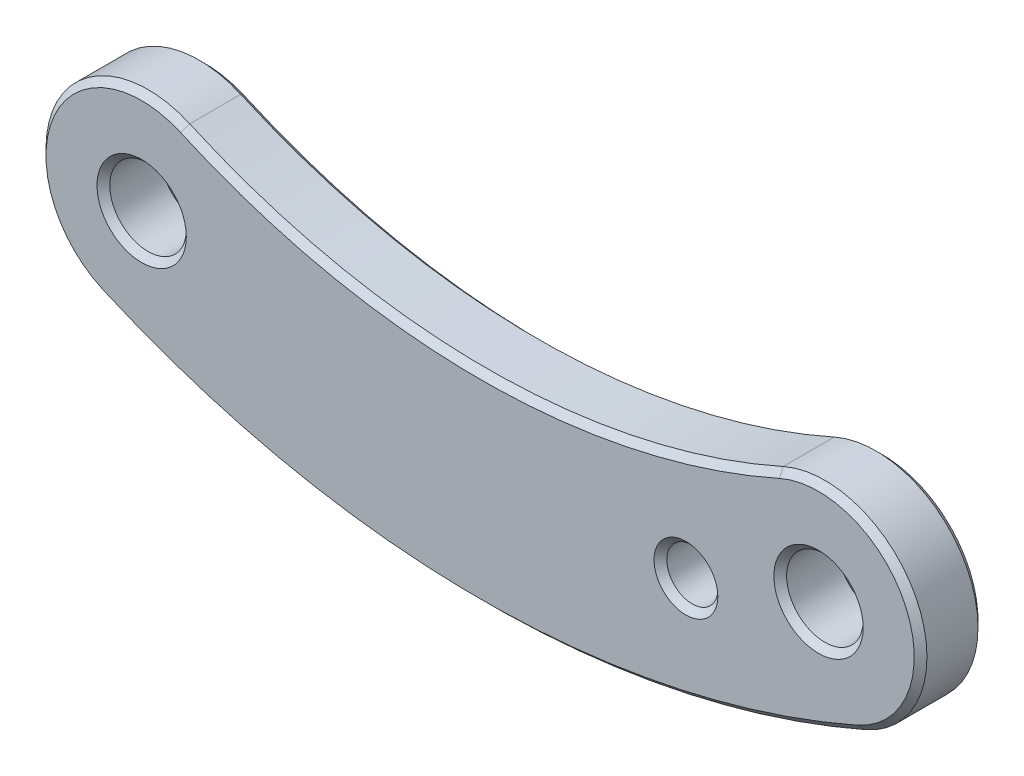
ISO-10303-21;
HEADER;
FILE_DESCRIPTION(('STEP AP214'),'2;1');
FILE_NAME('part.step','',(''),(''),'','','');
FILE_SCHEMA(('AUTOMOTIVE_DESIGN { 1 0 10303 214 1 1 1 1 }'));
ENDSEC;
DATA;
#1=APPLICATION_CONTEXT('core data for automotive mechanical design processes');
#2=APPLICATION_PROTOCOL_DEFINITION('international standard','automotive_design',2000,#1);
#3=PRODUCT_CONTEXT('',#1,'mechanical');
#4=PRODUCT('Part','Part','',(#3));
#5=PRODUCT_RELATED_PRODUCT_CATEGORY('part','',(#4));
#6=PRODUCT_DEFINITION_FORMATION('','',#4);
#7=PRODUCT_DEFINITION_CONTEXT('part definition',#1,'design');
#8=PRODUCT_DEFINITION('design','',#6,#7);
#9=PRODUCT_DEFINITION_SHAPE('','',#8);
#10=(LENGTH_UNIT() NAMED_UNIT(*) SI_UNIT(.MILLI.,.METRE.));
#11=(NAMED_UNIT(*) PLANE_ANGLE_UNIT() SI_UNIT($,.RADIAN.));
#12=(NAMED_UNIT(*) SI_UNIT($,.STERADIAN.) SOLID_ANGLE_UNIT());
#13=UNCERTAINTY_MEASURE_WITH_UNIT(LENGTH_MEASURE(1.E-05),#10,'distance_accuracy_value','');
#14=(GEOMETRIC_REPRESENTATION_CONTEXT(3) GLOBAL_UNCERTAINTY_ASSIGNED_CONTEXT((#13)) GLOBAL_UNIT_ASSIGNED_CONTEXT((#10,
#11,#12)) REPRESENTATION_CONTEXT('',''));
#15=CARTESIAN_POINT('',(0.,0.,0.));
#16=DIRECTION('',(0.,0.,1.));
#17=DIRECTION('',(1.,0.,0.));
#18=AXIS2_PLACEMENT_3D('',#15,#16,#17);
#19=CARTESIAN_POINT('',(-13.265,30.2165480324937,5.));
#20=DIRECTION('',(0.,0.,1.));
#21=DIRECTION('',(1.,0.,0.));
#22=AXIS2_PLACEMENT_3D('',#19,#20,#21);
#23=PLANE('',#22);
#24=CARTESIAN_POINT('',(-10.3960099464018,-3.59485426607447,5.));
#25=DIRECTION('',(0.,0.,1.));
#26=DIRECTION('',(1.,0.,0.));
#27=AXIS2_PLACEMENT_3D('',#24,#25,#26);
#28=CIRCLE('',#27,2.49999999999999);
#29=CARTESIAN_POINT('',(-7.89600994640185,-3.59485426607447,5.));
#30=VERTEX_POINT('',#29);
#31=EDGE_CURVE('E139',#30,#30,#28,.F.);
#32=ORIENTED_EDGE('',*,*,#31,.T.);
#33=EDGE_LOOP('',(#32));
#34=FACE_BOUND('',#33,.T.);
#35=CARTESIAN_POINT('',(0.,0.,5.));
#36=DIRECTION('',(0.,0.,1.));
#37=DIRECTION('',(1.,0.,0.));
#38=AXIS2_PLACEMENT_3D('',#35,#36,#37);
#39=CIRCLE('',#38,3.5);
#40=CARTESIAN_POINT('',(3.5,0.,5.));
#41=VERTEX_POINT('',#40);
#42=EDGE_CURVE('E162',#41,#41,#39,.F.);
#43=ORIENTED_EDGE('',*,*,#42,.T.);
#44=EDGE_LOOP('',(#43));
#45=FACE_BOUND('',#44,.T.);
#46=CARTESIAN_POINT('',(-53.06,0.,5.));
#47=DIRECTION('',(0.,0.,1.));
#48=DIRECTION('',(1.,0.,0.));
#49=AXIS2_PLACEMENT_3D('',#46,#47,#48);
#50=CIRCLE('',#49,3.49999999999998);
#51=CARTESIAN_POINT('',(-49.56,0.,5.));
#52=VERTEX_POINT('',#51);
#53=EDGE_CURVE('E165',#52,#52,#50,.F.);
#54=ORIENTED_EDGE('',*,*,#53,.T.);
#55=EDGE_LOOP('',(#54));
#56=FACE_BOUND('',#55,.T.);
#57=CARTESIAN_POINT('',(0.,0.,5.));
#58=DIRECTION('',(0.,0.,1.));
#59=DIRECTION('',(1.,0.,0.));
#60=AXIS2_PLACEMENT_3D('',#57,#58,#59);
#61=CIRCLE('',#60,7.5);
#62=CARTESIAN_POINT('',(3.01477272727272,-6.86739728011221,5.));
#63=VERTEX_POINT('',#62);
#64=CARTESIAN_POINT('',(-3.06115384615384,6.84684870069272,5.));
#65=VERTEX_POINT('',#64);
#66=EDGE_CURVE('E116',#63,#65,#61,.T.);
#67=ORIENTED_EDGE('',*,*,#66,.T.);
#68=CARTESIAN_POINT('',(-26.53,59.3393554060035,5.));
#69=DIRECTION('',(0.,0.,1.));
#70=DIRECTION('',(1.,0.,0.));
#71=AXIS2_PLACEMENT_3D('',#68,#69,#70);
#72=CIRCLE('',#71,57.5);
#73=CARTESIAN_POINT('',(-49.9988461538462,6.84684870069272,5.));
#74=VERTEX_POINT('',#73);
#75=EDGE_CURVE('E112',#65,#74,#72,.F.);
#76=ORIENTED_EDGE('',*,*,#75,.T.);
#77=CARTESIAN_POINT('',(-53.06,0.,5.));
#78=DIRECTION('',(0.,0.,1.));
#79=DIRECTION('',(1.,0.,0.));
#80=AXIS2_PLACEMENT_3D('',#77,#78,#79);
#81=CIRCLE('',#80,7.49999999999999);
#82=CARTESIAN_POINT('',(-56.0747727272727,-6.86739728011222,5.));
#83=VERTEX_POINT('',#82);
#84=EDGE_CURVE('E107',#74,#83,#81,.T.);
#85=ORIENTED_EDGE('',*,*,#84,.T.);
#86=CARTESIAN_POINT('',(-26.53,60.4330960649874,5.));
#87=DIRECTION('',(0.,0.,1.));
#88=DIRECTION('',(1.,0.,0.));
#89=AXIS2_PLACEMENT_3D('',#86,#87,#88);
#90=CIRCLE('',#89,73.5);
#91=EDGE_CURVE('E109',#83,#63,#90,.T.);
#92=ORIENTED_EDGE('',*,*,#91,.T.);
#93=EDGE_LOOP('',(#67,#76,#85,#92));
#94=FACE_BOUND('',#93,.T.);
#95=ADVANCED_FACE('F39',(#34,#45,#56,#94),#23,.T.);
#96=CARTESIAN_POINT('',(-13.265,30.2165480324937,0.));
#97=DIRECTION('',(0.,0.,1.));
#98=DIRECTION('',(1.,0.,0.));
#99=AXIS2_PLACEMENT_3D('',#96,#97,#98);
#100=PLANE('',#99);
#101=CARTESIAN_POINT('',(-10.3960099464018,-3.59485426607447,0.));
#102=DIRECTION('',(0.,0.,1.));
#103=DIRECTION('',(1.,0.,0.));
#104=AXIS2_PLACEMENT_3D('',#101,#102,#103);
#105=CIRCLE('',#104,2.49999999999999);
#106=CARTESIAN_POINT('',(-7.89600994640185,-3.59485426607447,0.));
#107=VERTEX_POINT('',#106);
#108=EDGE_CURVE('E11',#107,#107,#105,.T.);
#109=ORIENTED_EDGE('',*,*,#108,.T.);
#110=EDGE_LOOP('',(#109));
#111=FACE_BOUND('',#110,.T.);
#112=CARTESIAN_POINT('',(0.,0.,0.));
#113=DIRECTION('',(0.,0.,1.));
#114=DIRECTION('',(1.,0.,0.));
#115=AXIS2_PLACEMENT_3D('',#112,#113,#114);
#116=CIRCLE('',#115,3.49999999999999);
#117=CARTESIAN_POINT('',(3.49999999999999,0.,0.));
#118=VERTEX_POINT('',#117);
#119=EDGE_CURVE('E183',#118,#118,#116,.T.);
#120=ORIENTED_EDGE('',*,*,#119,.T.);
#121=EDGE_LOOP('',(#120));
#122=FACE_BOUND('',#121,.T.);
#123=CARTESIAN_POINT('',(-53.06,0.,0.));
#124=DIRECTION('',(0.,0.,1.));
#125=DIRECTION('',(1.,0.,0.));
#126=AXIS2_PLACEMENT_3D('',#123,#124,#125);
#127=CIRCLE('',#126,3.49999999999999);
#128=CARTESIAN_POINT('',(-49.56,0.,0.));
#129=VERTEX_POINT('',#128);
#130=EDGE_CURVE('E180',#129,#129,#127,.T.);
#131=ORIENTED_EDGE('',*,*,#130,.T.);
#132=EDGE_LOOP('',(#131));
#133=FACE_BOUND('',#132,.T.);
#134=CARTESIAN_POINT('',(-53.06,0.,0.));
#135=DIRECTION('',(0.,0.,1.));
#136=DIRECTION('',(1.,0.,0.));
#137=AXIS2_PLACEMENT_3D('',#134,#135,#136);
#138=CIRCLE('',#137,7.49999999999999);
#139=CARTESIAN_POINT('',(-56.0747727272727,-6.8673972801122,0.));
#140=VERTEX_POINT('',#139);
#141=CARTESIAN_POINT('',(-49.9988461538462,6.84684870069272,0.));
#142=VERTEX_POINT('',#141);
#143=EDGE_CURVE('E175',#140,#142,#138,.F.);
#144=ORIENTED_EDGE('',*,*,#143,.T.);
#145=CARTESIAN_POINT('',(-26.53,59.3393554060035,0.));
#146=DIRECTION('',(0.,0.,1.));
#147=DIRECTION('',(1.,0.,0.));
#148=AXIS2_PLACEMENT_3D('',#145,#146,#147);
#149=CIRCLE('',#148,57.5);
#150=CARTESIAN_POINT('',(-3.06115384615384,6.84684870069272,0.));
#151=VERTEX_POINT('',#150);
#152=EDGE_CURVE('E177',#142,#151,#149,.T.);
#153=ORIENTED_EDGE('',*,*,#152,.T.);
#154=CARTESIAN_POINT('',(0.,0.,0.));
#155=DIRECTION('',(0.,0.,1.));
#156=DIRECTION('',(1.,0.,0.));
#157=AXIS2_PLACEMENT_3D('',#154,#155,#156);
#158=CIRCLE('',#157,7.5);
#159=CARTESIAN_POINT('',(3.01477272727271,-6.86739728011219,0.));
#160=VERTEX_POINT('',#159);
#161=EDGE_CURVE('E173',#151,#160,#158,.F.);
#162=ORIENTED_EDGE('',*,*,#161,.T.);
#163=CARTESIAN_POINT('',(-26.53,60.4330960649874,0.));
#164=DIRECTION('',(0.,0.,1.));
#165=DIRECTION('',(1.,0.,0.));
#166=AXIS2_PLACEMENT_3D('',#163,#164,#165);
#167=CIRCLE('',#166,73.5);
#168=EDGE_CURVE('E168',#160,#140,#167,.F.);
#169=ORIENTED_EDGE('',*,*,#168,.T.);
#170=EDGE_LOOP('',(#144,#153,#162,#169));
#171=FACE_BOUND('',#170,.T.);
#172=ADVANCED_FACE('F157',(#111,#122,#133,#171),#100,.F.);
#173=CARTESIAN_POINT('',(-26.53,60.4330960649874,5.));
#174=DIRECTION('',(0.,0.,-1.));
#175=DIRECTION('',(-1.,0.,0.));
#176=AXIS2_PLACEMENT_3D('',#173,#174,#175);
#177=CYLINDRICAL_SURFACE('',#176,74.);
#178=DIRECTION('',(0.,0.,-1.));
#179=VECTOR('',#178,1.);
#180=CARTESIAN_POINT('',(-56.2757575757576,-7.32522376545301,5.));
#181=LINE('',#180,#179);
#182=CARTESIAN_POINT('',(-56.2757575757576,-7.32522376545301,4.50000000000001));
#183=VERTEX_POINT('',#182);
#184=CARTESIAN_POINT('',(-56.2757575757576,-7.32522376545301,0.5));
#185=VERTEX_POINT('',#184);
#186=EDGE_CURVE('E215',#183,#185,#181,.T.);
#187=ORIENTED_EDGE('',*,*,#186,.T.);
#188=CARTESIAN_POINT('',(-26.53,60.4330960649874,0.5));
#189=DIRECTION('',(0.,0.,1.));
#190=DIRECTION('',(1.,0.,0.));
#191=AXIS2_PLACEMENT_3D('',#188,#189,#190);
#192=CIRCLE('',#191,74.);
#193=CARTESIAN_POINT('',(3.21575757575757,-7.32522376545302,0.5));
#194=VERTEX_POINT('',#193);
#195=EDGE_CURVE('E55',#185,#194,#192,.T.);
#196=ORIENTED_EDGE('',*,*,#195,.T.);
#197=DIRECTION('',(0.,0.,-1.));
#198=VECTOR('',#197,1.);
#199=CARTESIAN_POINT('',(3.21575757575757,-7.32522376545302,5.));
#200=LINE('',#199,#198);
#201=CARTESIAN_POINT('',(3.21575757575757,-7.32522376545302,4.50000000000001));
#202=VERTEX_POINT('',#201);
#203=EDGE_CURVE('E230',#202,#194,#200,.T.);
#204=ORIENTED_EDGE('',*,*,#203,.F.);
#205=CARTESIAN_POINT('',(-26.53,60.4330960649874,4.50000000000001));
#206=DIRECTION('',(0.,0.,1.));
#207=DIRECTION('',(1.,0.,0.));
#208=AXIS2_PLACEMENT_3D('',#205,#206,#207);
#209=CIRCLE('',#208,74.);
#210=EDGE_CURVE('E204',#202,#183,#209,.F.);
#211=ORIENTED_EDGE('',*,*,#210,.T.);
#212=EDGE_LOOP('',(#187,#196,#204,#211));
#213=FACE_BOUND('',#212,.T.);
#214=ADVANCED_FACE('F327',(#213),#177,.T.);
#215=CARTESIAN_POINT('',(0.,0.,5.));
#216=DIRECTION('',(0.,0.,-1.));
#217=DIRECTION('',(-1.,0.,0.));
#218=AXIS2_PLACEMENT_3D('',#215,#216,#217);
#219=CYLINDRICAL_SURFACE('',#218,8.);
#220=ORIENTED_EDGE('',*,*,#203,.T.);
#221=CARTESIAN_POINT('',(0.,0.,0.5));
#222=DIRECTION('',(0.,0.,1.));
#223=DIRECTION('',(1.,0.,0.));
#224=AXIS2_PLACEMENT_3D('',#221,#222,#223);
#225=CIRCLE('',#224,8.);
#226=CARTESIAN_POINT('',(-3.26523076923076,7.30330528073889,0.5));
#227=VERTEX_POINT('',#226);
#228=EDGE_CURVE('E202',#194,#227,#225,.T.);
#229=ORIENTED_EDGE('',*,*,#228,.T.);
#230=DIRECTION('',(0.,0.,-1.));
#231=VECTOR('',#230,1.);
#232=CARTESIAN_POINT('',(-3.26523076923076,7.30330528073889,5.));
#233=LINE('',#232,#231);
#234=CARTESIAN_POINT('',(-3.26523076923076,7.30330528073889,4.50000000000001));
#235=VERTEX_POINT('',#234);
#236=EDGE_CURVE('E224',#235,#227,#233,.T.);
#237=ORIENTED_EDGE('',*,*,#236,.F.);
#238=CARTESIAN_POINT('',(0.,0.,4.50000000000001));
#239=DIRECTION('',(0.,0.,1.));
#240=DIRECTION('',(1.,0.,0.));
#241=AXIS2_PLACEMENT_3D('',#238,#239,#240);
#242=CIRCLE('',#241,8.);
#243=EDGE_CURVE('E62',#235,#202,#242,.F.);
#244=ORIENTED_EDGE('',*,*,#243,.T.);
#245=EDGE_LOOP('',(#220,#229,#237,#244));
#246=FACE_BOUND('',#245,.T.);
#247=ADVANCED_FACE('F228',(#246),#219,.T.);
#248=CARTESIAN_POINT('',(-26.53,59.3393554060035,5.));
#249=DIRECTION('',(0.,0.,-1.));
#250=DIRECTION('',(-1.,0.,0.));
#251=AXIS2_PLACEMENT_3D('',#248,#249,#250);
#252=CYLINDRICAL_SURFACE('',#251,57.);
#253=ORIENTED_EDGE('',*,*,#236,.T.);
#254=CARTESIAN_POINT('',(-26.53,59.3393554060035,0.5));
#255=DIRECTION('',(0.,0.,1.));
#256=DIRECTION('',(1.,0.,0.));
#257=AXIS2_PLACEMENT_3D('',#254,#255,#256);
#258=CIRCLE('',#257,57.);
#259=CARTESIAN_POINT('',(-49.7947692307693,7.30330528073891,0.5));
#260=VERTEX_POINT('',#259);
#261=EDGE_CURVE('E195',#227,#260,#258,.F.);
#262=ORIENTED_EDGE('',*,*,#261,.T.);
#263=DIRECTION('',(0.,0.,-1.));
#264=VECTOR('',#263,1.);
#265=CARTESIAN_POINT('',(-49.7947692307693,7.30330528073891,5.));
#266=LINE('',#265,#264);
#267=CARTESIAN_POINT('',(-49.7947692307693,7.30330528073891,4.50000000000001));
#268=VERTEX_POINT('',#267);
#269=EDGE_CURVE('E227',#268,#260,#266,.T.);
#270=ORIENTED_EDGE('',*,*,#269,.F.);
#271=CARTESIAN_POINT('',(-26.53,59.3393554060035,4.50000000000001));
#272=DIRECTION('',(0.,0.,1.));
#273=DIRECTION('',(1.,0.,0.));
#274=AXIS2_PLACEMENT_3D('',#271,#272,#273);
#275=CIRCLE('',#274,57.);
#276=EDGE_CURVE('E192',#268,#235,#275,.T.);
#277=ORIENTED_EDGE('',*,*,#276,.T.);
#278=EDGE_LOOP('',(#253,#262,#270,#277));
#279=FACE_BOUND('',#278,.T.);
#280=ADVANCED_FACE('F223',(#279),#252,.F.);
#281=CARTESIAN_POINT('',(-53.06,0.,5.));
#282=DIRECTION('',(0.,0.,-1.));
#283=DIRECTION('',(-1.,0.,0.));
#284=AXIS2_PLACEMENT_3D('',#281,#282,#283);
#285=CYLINDRICAL_SURFACE('',#284,7.99999999999998);
#286=ORIENTED_EDGE('',*,*,#269,.T.);
#287=CARTESIAN_POINT('',(-53.06,0.,0.5));
#288=DIRECTION('',(0.,0.,1.));
#289=DIRECTION('',(1.,0.,0.));
#290=AXIS2_PLACEMENT_3D('',#287,#288,#289);
#291=CIRCLE('',#290,7.99999999999998);
#292=EDGE_CURVE('E199',#260,#185,#291,.T.);
#293=ORIENTED_EDGE('',*,*,#292,.T.);
#294=ORIENTED_EDGE('',*,*,#186,.F.);
#295=CARTESIAN_POINT('',(-53.06,0.,4.50000000000001));
#296=DIRECTION('',(0.,0.,1.));
#297=DIRECTION('',(1.,0.,0.));
#298=AXIS2_PLACEMENT_3D('',#295,#296,#297);
#299=CIRCLE('',#298,7.99999999999998);
#300=EDGE_CURVE('E130',#183,#268,#299,.F.);
#301=ORIENTED_EDGE('',*,*,#300,.T.);
#302=EDGE_LOOP('',(#286,#293,#294,#301));
#303=FACE_BOUND('',#302,.T.);
#304=ADVANCED_FACE('F334',(#303),#285,.T.);
#305=CARTESIAN_POINT('',(0.,0.,5.));
#306=DIRECTION('',(0.,0.,-1.));
#307=DIRECTION('',(-1.,0.,0.));
#308=AXIS2_PLACEMENT_3D('',#305,#306,#307);
#309=CYLINDRICAL_SURFACE('',#308,3.);
#310=CARTESIAN_POINT('',(0.,0.,4.5));
#311=DIRECTION('',(0.,0.,1.));
#312=DIRECTION('',(1.,0.,0.));
#313=AXIS2_PLACEMENT_3D('',#310,#311,#312);
#314=CIRCLE('',#313,3.);
#315=CARTESIAN_POINT('',(3.,0.,4.5));
#316=VERTEX_POINT('',#315);
#317=EDGE_CURVE('E127',#316,#316,#314,.T.);
#318=ORIENTED_EDGE('',*,*,#317,.T.);
#319=EDGE_LOOP('',(#318));
#320=FACE_BOUND('',#319,.T.);
#321=CARTESIAN_POINT('',(0.,0.,0.499999999999993));
#322=DIRECTION('',(0.,0.,1.));
#323=DIRECTION('',(1.,0.,0.));
#324=AXIS2_PLACEMENT_3D('',#321,#322,#323);
#325=CIRCLE('',#324,3.);
#326=CARTESIAN_POINT('',(3.,0.,0.499999999999993));
#327=VERTEX_POINT('',#326);
#328=EDGE_CURVE('E232',#327,#327,#325,.F.);
#329=ORIENTED_EDGE('',*,*,#328,.T.);
#330=EDGE_LOOP('',(#329));
#331=FACE_BOUND('',#330,.T.);
#332=ADVANCED_FACE('F337',(#320,#331),#309,.F.);
#333=CARTESIAN_POINT('',(-53.06,0.,5.));
#334=DIRECTION('',(0.,0.,-1.));
#335=DIRECTION('',(-1.,0.,0.));
#336=AXIS2_PLACEMENT_3D('',#333,#334,#335);
#337=CYLINDRICAL_SURFACE('',#336,2.99999999999999);
#338=CARTESIAN_POINT('',(-53.06,0.,0.499999999999999));
#339=DIRECTION('',(0.,0.,1.));
#340=DIRECTION('',(1.,0.,0.));
#341=AXIS2_PLACEMENT_3D('',#338,#339,#340);
#342=CIRCLE('',#341,2.99999999999999);
#343=CARTESIAN_POINT('',(-50.06,0.,0.499999999999999));
#344=VERTEX_POINT('',#343);
#345=EDGE_CURVE('E189',#344,#344,#342,.F.);
#346=ORIENTED_EDGE('',*,*,#345,.T.);
#347=EDGE_LOOP('',(#346));
#348=FACE_BOUND('',#347,.T.);
#349=CARTESIAN_POINT('',(-53.06,0.,4.50000000000002));
#350=DIRECTION('',(0.,0.,1.));
#351=DIRECTION('',(1.,0.,0.));
#352=AXIS2_PLACEMENT_3D('',#349,#350,#351);
#353=CIRCLE('',#352,2.99999999999999);
#354=CARTESIAN_POINT('',(-50.06,0.,4.50000000000002));
#355=VERTEX_POINT('',#354);
#356=EDGE_CURVE('E186',#355,#355,#353,.T.);
#357=ORIENTED_EDGE('',*,*,#356,.T.);
#358=EDGE_LOOP('',(#357));
#359=FACE_BOUND('',#358,.T.);
#360=ADVANCED_FACE('F325',(#348,#359),#337,.F.);
#361=CARTESIAN_POINT('',(0.,0.,4.5));
#362=DIRECTION('',(0.,0.,1.));
#363=DIRECTION('',(1.,0.,0.));
#364=AXIS2_PLACEMENT_3D('',#361,#362,#363);
#365=CONICAL_SURFACE('',#364,3.,0.785398163397451);
#366=ORIENTED_EDGE('',*,*,#42,.F.);
#367=EDGE_LOOP('',(#366));
#368=FACE_BOUND('',#367,.T.);
#369=ORIENTED_EDGE('',*,*,#317,.F.);
#370=EDGE_LOOP('',(#369));
#371=FACE_BOUND('',#370,.T.);
#372=ADVANCED_FACE('F319',(#368,#371),#365,.F.);
#373=CARTESIAN_POINT('',(0.,0.,0.));
#374=DIRECTION('',(0.,0.,-1.));
#375=DIRECTION('',(-1.,0.,0.));
#376=AXIS2_PLACEMENT_3D('',#373,#374,#375);
#377=CONICAL_SURFACE('',#376,3.49999999999999,0.785398163397445);
#378=ORIENTED_EDGE('',*,*,#328,.F.);
#379=EDGE_LOOP('',(#378));
#380=FACE_BOUND('',#379,.T.);
#381=ORIENTED_EDGE('',*,*,#119,.F.);
#382=EDGE_LOOP('',(#381));
#383=FACE_BOUND('',#382,.T.);
#384=ADVANCED_FACE('F312',(#380,#383),#377,.F.);
#385=CARTESIAN_POINT('',(-53.06,0.,0.));
#386=DIRECTION('',(0.,0.,-1.));
#387=DIRECTION('',(-1.,0.,0.));
#388=AXIS2_PLACEMENT_3D('',#385,#386,#387);
#389=CONICAL_SURFACE('',#388,3.49999999999999,0.785398163397445);
#390=ORIENTED_EDGE('',*,*,#345,.F.);
#391=EDGE_LOOP('',(#390));
#392=FACE_BOUND('',#391,.T.);
#393=ORIENTED_EDGE('',*,*,#130,.F.);
#394=EDGE_LOOP('',(#393));
#395=FACE_BOUND('',#394,.T.);
#396=ADVANCED_FACE('F306',(#392,#395),#389,.F.);
#397=CARTESIAN_POINT('',(-53.06,0.,4.50000000000002));
#398=DIRECTION('',(0.,0.,1.));
#399=DIRECTION('',(1.,0.,0.));
#400=AXIS2_PLACEMENT_3D('',#397,#398,#399);
#401=CONICAL_SURFACE('',#400,2.99999999999999,0.785398163397452);
#402=ORIENTED_EDGE('',*,*,#53,.F.);
#403=EDGE_LOOP('',(#402));
#404=FACE_BOUND('',#403,.T.);
#405=ORIENTED_EDGE('',*,*,#356,.F.);
#406=EDGE_LOOP('',(#405));
#407=FACE_BOUND('',#406,.T.);
#408=ADVANCED_FACE('F282',(#404,#407),#401,.F.);
#409=CARTESIAN_POINT('',(-26.53,60.4330960649874,0.5));
#410=DIRECTION('',(0.,0.,1.));
#411=DIRECTION('',(1.,0.,0.));
#412=AXIS2_PLACEMENT_3D('',#409,#410,#411);
#413=CONICAL_SURFACE('',#412,74.,0.785398163397435);
#414=DIRECTION('',(-0.284235498558773,-0.647464424782581,0.707106781186552));
#415=VECTOR('',#414,1.);
#416=CARTESIAN_POINT('',(-56.0747727272727,-6.8673972801122,0.));
#417=LINE('',#416,#415);
#418=EDGE_CURVE('E210',#140,#185,#417,.T.);
#419=ORIENTED_EDGE('',*,*,#418,.F.);
#420=ORIENTED_EDGE('',*,*,#168,.F.);
#421=DIRECTION('',(-0.284235498558776,0.64746442478259,-0.707106781186543));
#422=VECTOR('',#421,1.);
#423=CARTESIAN_POINT('',(3.21575757575756,-7.32522376545301,0.500000000000001));
#424=LINE('',#423,#422);
#425=EDGE_CURVE('E213',#194,#160,#424,.T.);
#426=ORIENTED_EDGE('',*,*,#425,.F.);
#427=ORIENTED_EDGE('',*,*,#195,.F.);
#428=EDGE_LOOP('',(#419,#420,#426,#427));
#429=FACE_BOUND('',#428,.T.);
#430=ADVANCED_FACE('F274',(#429),#413,.T.);
#431=CARTESIAN_POINT('',(0.,0.,0.5));
#432=DIRECTION('',(0.,0.,1.));
#433=DIRECTION('',(1.,0.,0.));
#434=AXIS2_PLACEMENT_3D('',#431,#432,#433);
#435=CONICAL_SURFACE('',#434,8.,0.785398163397441);
#436=ORIENTED_EDGE('',*,*,#425,.T.);
#437=ORIENTED_EDGE('',*,*,#161,.F.);
#438=DIRECTION('',(0.288608352382754,-0.645527086135745,-0.707106781186552));
#439=VECTOR('',#438,1.);
#440=CARTESIAN_POINT('',(-3.26523076923076,7.30330528073889,0.5));
#441=LINE('',#440,#439);
#442=EDGE_CURVE('E208',#227,#151,#441,.T.);
#443=ORIENTED_EDGE('',*,*,#442,.F.);
#444=ORIENTED_EDGE('',*,*,#228,.F.);
#445=EDGE_LOOP('',(#436,#437,#443,#444));
#446=FACE_BOUND('',#445,.T.);
#447=ADVANCED_FACE('F281',(#446),#435,.T.);
#448=CARTESIAN_POINT('',(-53.06,0.,0.5));
#449=DIRECTION('',(0.,0.,1.));
#450=DIRECTION('',(1.,0.,0.));
#451=AXIS2_PLACEMENT_3D('',#448,#449,#450);
#452=CONICAL_SURFACE('',#451,7.99999999999998,0.785398163397441);
#453=ORIENTED_EDGE('',*,*,#418,.T.);
#454=ORIENTED_EDGE('',*,*,#292,.F.);
#455=DIRECTION('',(0.28860835238275,0.645527086135747,0.707106781186552));
#456=VECTOR('',#455,1.);
#457=CARTESIAN_POINT('',(-49.9988461538462,6.84684870069272,0.));
#458=LINE('',#457,#456);
#459=EDGE_CURVE('E133',#142,#260,#458,.T.);
#460=ORIENTED_EDGE('',*,*,#459,.F.);
#461=ORIENTED_EDGE('',*,*,#143,.F.);
#462=EDGE_LOOP('',(#453,#454,#460,#461));
#463=FACE_BOUND('',#462,.T.);
#464=ADVANCED_FACE('F289',(#463),#452,.T.);
#465=CARTESIAN_POINT('',(-26.53,59.3393554060035,0.5));
#466=DIRECTION('',(0.,0.,-1.));
#467=DIRECTION('',(-1.,0.,0.));
#468=AXIS2_PLACEMENT_3D('',#465,#466,#467);
#469=CONICAL_SURFACE('',#468,57.,0.785398163397441);
#470=ORIENTED_EDGE('',*,*,#442,.T.);
#471=ORIENTED_EDGE('',*,*,#152,.F.);
#472=ORIENTED_EDGE('',*,*,#459,.T.);
#473=ORIENTED_EDGE('',*,*,#261,.F.);
#474=EDGE_LOOP('',(#470,#471,#472,#473));
#475=FACE_BOUND('',#474,.T.);
#476=ADVANCED_FACE('F250',(#475),#469,.F.);
#477=CARTESIAN_POINT('',(-26.53,60.4330960649874,5.));
#478=DIRECTION('',(0.,0.,-1.));
#479=DIRECTION('',(-1.,0.,0.));
#480=AXIS2_PLACEMENT_3D('',#477,#478,#479);
#481=CONICAL_SURFACE('',#480,73.5,0.785398163397428);
#482=DIRECTION('',(0.284235498558769,0.647464424782577,0.707106781186558));
#483=VECTOR('',#482,1.);
#484=CARTESIAN_POINT('',(-56.2757575757576,-7.32522376545301,4.50000000000001));
#485=LINE('',#484,#483);
#486=EDGE_CURVE('E122',#183,#83,#485,.T.);
#487=ORIENTED_EDGE('',*,*,#486,.F.);
#488=ORIENTED_EDGE('',*,*,#210,.F.);
#489=DIRECTION('',(0.284235498558774,-0.647464424782586,-0.707106781186547));
#490=VECTOR('',#489,1.);
#491=CARTESIAN_POINT('',(3.01477272727272,-6.86739728011221,5.));
#492=LINE('',#491,#490);
#493=EDGE_CURVE('E125',#63,#202,#492,.T.);
#494=ORIENTED_EDGE('',*,*,#493,.F.);
#495=ORIENTED_EDGE('',*,*,#91,.F.);
#496=EDGE_LOOP('',(#487,#488,#494,#495));
#497=FACE_BOUND('',#496,.T.);
#498=ADVANCED_FACE('F120',(#497),#481,.T.);
#499=CARTESIAN_POINT('',(0.,0.,5.));
#500=DIRECTION('',(0.,0.,-1.));
#501=DIRECTION('',(-1.,0.,0.));
#502=AXIS2_PLACEMENT_3D('',#499,#500,#501);
#503=CONICAL_SURFACE('',#502,7.5,0.785398163397448);
#504=ORIENTED_EDGE('',*,*,#493,.T.);
#505=ORIENTED_EDGE('',*,*,#243,.F.);
#506=DIRECTION('',(-0.288608352382756,0.64552708613575,-0.707106781186547));
#507=VECTOR('',#506,1.);
#508=CARTESIAN_POINT('',(-3.06115384615384,6.84684870069272,5.));
#509=LINE('',#508,#507);
#510=EDGE_CURVE('E131',#65,#235,#509,.T.);
#511=ORIENTED_EDGE('',*,*,#510,.F.);
#512=ORIENTED_EDGE('',*,*,#66,.F.);
#513=EDGE_LOOP('',(#504,#505,#511,#512));
#514=FACE_BOUND('',#513,.T.);
#515=ADVANCED_FACE('F242',(#514),#503,.T.);
#516=CARTESIAN_POINT('',(-53.06,0.,5.));
#517=DIRECTION('',(0.,0.,-1.));
#518=DIRECTION('',(-1.,0.,0.));
#519=AXIS2_PLACEMENT_3D('',#516,#517,#518);
#520=CONICAL_SURFACE('',#519,7.49999999999999,0.785398163397448);
#521=ORIENTED_EDGE('',*,*,#486,.T.);
#522=ORIENTED_EDGE('',*,*,#84,.F.);
#523=DIRECTION('',(-0.288608352382752,-0.645527086135751,0.707106781186547));
#524=VECTOR('',#523,1.);
#525=CARTESIAN_POINT('',(-49.7947692307693,7.30330528073889,4.50000000000001));
#526=LINE('',#525,#524);
#527=EDGE_CURVE('E135',#268,#74,#526,.T.);
#528=ORIENTED_EDGE('',*,*,#527,.F.);
#529=ORIENTED_EDGE('',*,*,#300,.F.);
#530=EDGE_LOOP('',(#521,#522,#528,#529));
#531=FACE_BOUND('',#530,.T.);
#532=ADVANCED_FACE('F129',(#531),#520,.T.);
#533=CARTESIAN_POINT('',(-26.53,59.3393554060035,5.));
#534=DIRECTION('',(0.,0.,1.));
#535=DIRECTION('',(1.,0.,0.));
#536=AXIS2_PLACEMENT_3D('',#533,#534,#535);
#537=CONICAL_SURFACE('',#536,57.5,0.785398163397448);
#538=ORIENTED_EDGE('',*,*,#510,.T.);
#539=ORIENTED_EDGE('',*,*,#276,.F.);
#540=ORIENTED_EDGE('',*,*,#527,.T.);
#541=ORIENTED_EDGE('',*,*,#75,.F.);
#542=EDGE_LOOP('',(#538,#539,#540,#541));
#543=FACE_BOUND('',#542,.T.);
#544=ADVANCED_FACE('F218',(#543),#537,.F.);
#545=CARTESIAN_POINT('',(-10.3960099464018,-3.59485426607447,5.));
#546=DIRECTION('',(0.,0.,-1.));
#547=DIRECTION('',(-1.,0.,0.));
#548=AXIS2_PLACEMENT_3D('',#545,#546,#547);
#549=CYLINDRICAL_SURFACE('',#548,2.);
#550=CARTESIAN_POINT('',(-10.3960099464018,-3.59485426607447,4.5));
#551=DIRECTION('',(0.,0.,1.));
#552=DIRECTION('',(1.,0.,0.));
#553=AXIS2_PLACEMENT_3D('',#550,#551,#552);
#554=CIRCLE('',#553,2.);
#555=CARTESIAN_POINT('',(-8.39600994640185,-3.59485426607447,4.5));
#556=VERTEX_POINT('',#555);
#557=EDGE_CURVE('E48',#556,#556,#554,.T.);
#558=ORIENTED_EDGE('',*,*,#557,.T.);
#559=EDGE_LOOP('',(#558));
#560=FACE_BOUND('',#559,.T.);
#561=CARTESIAN_POINT('',(-10.3960099464018,-3.59485426607447,0.499999999999991));
#562=DIRECTION('',(0.,0.,1.));
#563=DIRECTION('',(1.,0.,0.));
#564=AXIS2_PLACEMENT_3D('',#561,#562,#563);
#565=CIRCLE('',#564,2.);
#566=CARTESIAN_POINT('',(-8.39600994640185,-3.59485426607447,0.499999999999991));
#567=VERTEX_POINT('',#566);
#568=EDGE_CURVE('E142',#567,#567,#565,.F.);
#569=ORIENTED_EDGE('',*,*,#568,.T.);
#570=EDGE_LOOP('',(#569));
#571=FACE_BOUND('',#570,.T.);
#572=ADVANCED_FACE('F147',(#560,#571),#549,.F.);
#573=CARTESIAN_POINT('',(-10.3960099464018,-3.59485426607447,5.));
#574=DIRECTION('',(0.,0.,1.));
#575=DIRECTION('',(1.,0.,0.));
#576=AXIS2_PLACEMENT_3D('',#573,#574,#575);
#577=CONICAL_SURFACE('',#576,2.49999999999999,0.785398163397441);
#578=ORIENTED_EDGE('',*,*,#557,.F.);
#579=EDGE_LOOP('',(#578));
#580=FACE_BOUND('',#579,.T.);
#581=ORIENTED_EDGE('',*,*,#31,.F.);
#582=EDGE_LOOP('',(#581));
#583=FACE_BOUND('',#582,.T.);
#584=ADVANCED_FACE('F150',(#580,#583),#577,.F.);
#585=CARTESIAN_POINT('',(-10.3960099464018,-3.59485426607447,0.));
#586=DIRECTION('',(0.,0.,-1.));
#587=DIRECTION('',(-1.,0.,0.));
#588=AXIS2_PLACEMENT_3D('',#585,#586,#587);
#589=CONICAL_SURFACE('',#588,2.49999999999999,0.785398163397448);
#590=ORIENTED_EDGE('',*,*,#568,.F.);
#591=EDGE_LOOP('',(#590));
#592=FACE_BOUND('',#591,.T.);
#593=ORIENTED_EDGE('',*,*,#108,.F.);
#594=EDGE_LOOP('',(#593));
#595=FACE_BOUND('',#594,.T.);
#596=ADVANCED_FACE('F42',(#592,#595),#589,.F.);
#597=CLOSED_SHELL('',(#95,#172,#214,#247,#280,#304,#332,#360,#372,#384,#396,#408,#430,#447,#464,
#476,#498,#515,#532,#544,#572,#584,#596));
#598=MANIFOLD_SOLID_BREP('B2',#597);
#599=ADVANCED_BREP_SHAPE_REPRESENTATION('',(#18,#598),#14);
#600=SHAPE_DEFINITION_REPRESENTATION(#9,#599);
ENDSEC;
END-ISO-10303-21;
